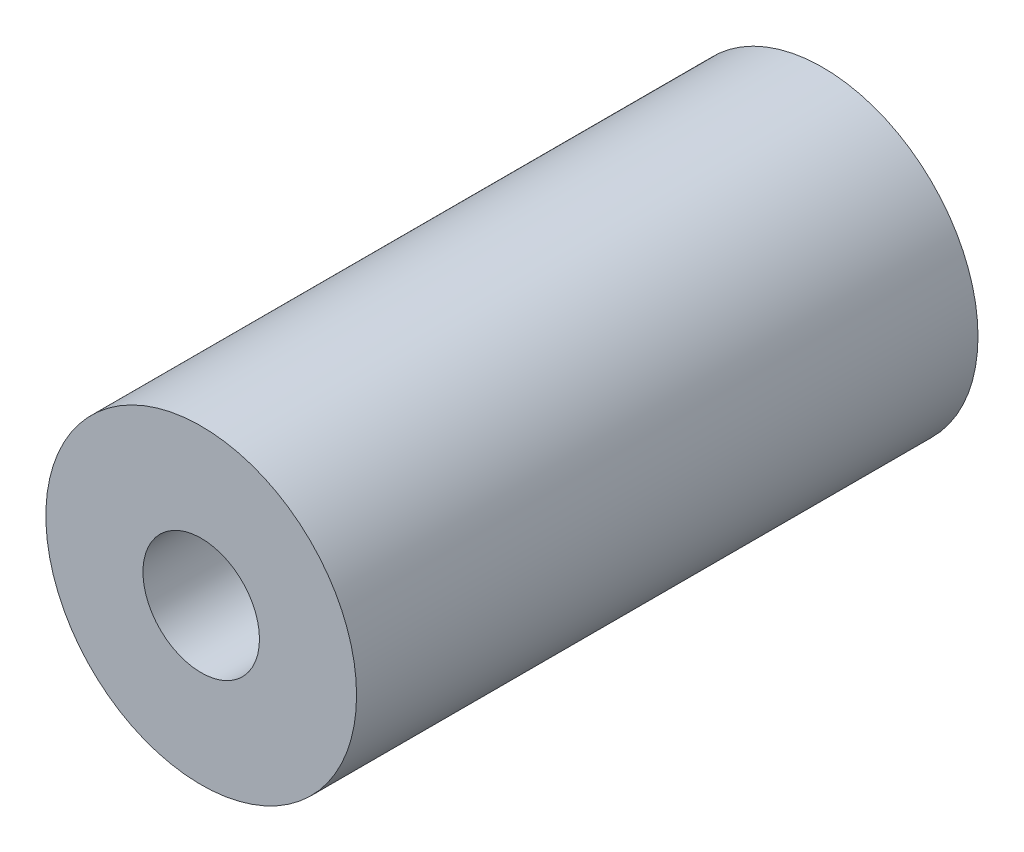
ISO-10303-21;
HEADER;
FILE_DESCRIPTION(('STEP AP214'),'2;1');
FILE_NAME('part.step','',(''),(''),'','','');
FILE_SCHEMA(('AUTOMOTIVE_DESIGN { 1 0 10303 214 1 1 1 1 }'));
ENDSEC;
DATA;
#1=APPLICATION_CONTEXT('core data for automotive mechanical design processes');
#2=APPLICATION_PROTOCOL_DEFINITION('international standard','automotive_design',2000,#1);
#3=PRODUCT_CONTEXT('',#1,'mechanical');
#4=PRODUCT('Part','Part','',(#3));
#5=PRODUCT_RELATED_PRODUCT_CATEGORY('part','',(#4));
#6=PRODUCT_DEFINITION_FORMATION('','',#4);
#7=PRODUCT_DEFINITION_CONTEXT('part definition',#1,'design');
#8=PRODUCT_DEFINITION('design','',#6,#7);
#9=PRODUCT_DEFINITION_SHAPE('','',#8);
#10=(LENGTH_UNIT() NAMED_UNIT(*) SI_UNIT(.MILLI.,.METRE.));
#11=(NAMED_UNIT(*) PLANE_ANGLE_UNIT() SI_UNIT($,.RADIAN.));
#12=(NAMED_UNIT(*) SI_UNIT($,.STERADIAN.) SOLID_ANGLE_UNIT());
#13=UNCERTAINTY_MEASURE_WITH_UNIT(LENGTH_MEASURE(1.E-05),#10,'distance_accuracy_value','');
#14=(GEOMETRIC_REPRESENTATION_CONTEXT(3) GLOBAL_UNCERTAINTY_ASSIGNED_CONTEXT((#13)) GLOBAL_UNIT_ASSIGNED_CONTEXT((#10,
#11,#12)) REPRESENTATION_CONTEXT('',''));
#15=CARTESIAN_POINT('',(0.,0.,0.));
#16=DIRECTION('',(0.,0.,1.));
#17=DIRECTION('',(1.,0.,0.));
#18=AXIS2_PLACEMENT_3D('',#15,#16,#17);
#19=CARTESIAN_POINT('',(0.,0.,16.));
#20=DIRECTION('',(0.,0.,1.));
#21=DIRECTION('',(1.,0.,0.));
#22=AXIS2_PLACEMENT_3D('',#19,#20,#21);
#23=PLANE('',#22);
#24=CARTESIAN_POINT('',(0.,0.,16.));
#25=DIRECTION('',(0.,0.,1.));
#26=DIRECTION('',(1.,0.,0.));
#27=AXIS2_PLACEMENT_3D('',#24,#25,#26);
#28=CIRCLE('',#27,4.);
#29=CARTESIAN_POINT('',(4.,0.,16.));
#30=VERTEX_POINT('',#29);
#31=EDGE_CURVE('E10',#30,#30,#28,.T.);
#32=ORIENTED_EDGE('',*,*,#31,.T.);
#33=EDGE_LOOP('',(#32));
#34=FACE_BOUND('',#33,.T.);
#35=CARTESIAN_POINT('',(0.,0.,16.));
#36=DIRECTION('',(0.,0.,1.));
#37=DIRECTION('',(1.,0.,0.));
#38=AXIS2_PLACEMENT_3D('',#35,#36,#37);
#39=CIRCLE('',#38,1.5);
#40=CARTESIAN_POINT('',(1.5,0.,16.));
#41=VERTEX_POINT('',#40);
#42=EDGE_CURVE('E41',#41,#41,#39,.T.);
#43=ORIENTED_EDGE('',*,*,#42,.F.);
#44=EDGE_LOOP('',(#43));
#45=FACE_BOUND('',#44,.T.);
#46=ADVANCED_FACE('F30',(#34,#45),#23,.T.);
#47=CARTESIAN_POINT('',(0.,0.,0.));
#48=DIRECTION('',(0.,0.,1.));
#49=DIRECTION('',(1.,0.,0.));
#50=AXIS2_PLACEMENT_3D('',#47,#48,#49);
#51=PLANE('',#50);
#52=CARTESIAN_POINT('',(0.,0.,0.));
#53=DIRECTION('',(0.,0.,1.));
#54=DIRECTION('',(1.,0.,0.));
#55=AXIS2_PLACEMENT_3D('',#52,#53,#54);
#56=CIRCLE('',#55,4.);
#57=CARTESIAN_POINT('',(4.,0.,0.));
#58=VERTEX_POINT('',#57);
#59=EDGE_CURVE('E34',#58,#58,#56,.T.);
#60=ORIENTED_EDGE('',*,*,#59,.F.);
#61=EDGE_LOOP('',(#60));
#62=FACE_BOUND('',#61,.T.);
#63=CARTESIAN_POINT('',(0.,0.,0.));
#64=DIRECTION('',(0.,0.,1.));
#65=DIRECTION('',(1.,0.,0.));
#66=AXIS2_PLACEMENT_3D('',#63,#64,#65);
#67=CIRCLE('',#66,1.5);
#68=CARTESIAN_POINT('',(1.5,0.,0.));
#69=VERTEX_POINT('',#68);
#70=EDGE_CURVE('E43',#69,#69,#67,.T.);
#71=ORIENTED_EDGE('',*,*,#70,.T.);
#72=EDGE_LOOP('',(#71));
#73=FACE_BOUND('',#72,.T.);
#74=ADVANCED_FACE('F53',(#62,#73),#51,.F.);
#75=CARTESIAN_POINT('',(0.,0.,16.));
#76=DIRECTION('',(0.,0.,-1.));
#77=DIRECTION('',(-1.,0.,0.));
#78=AXIS2_PLACEMENT_3D('',#75,#76,#77);
#79=CYLINDRICAL_SURFACE('',#78,4.);
#80=ORIENTED_EDGE('',*,*,#31,.F.);
#81=EDGE_LOOP('',(#80));
#82=FACE_BOUND('',#81,.T.);
#83=ORIENTED_EDGE('',*,*,#59,.T.);
#84=EDGE_LOOP('',(#83));
#85=FACE_BOUND('',#84,.T.);
#86=ADVANCED_FACE('F32',(#82,#85),#79,.T.);
#87=CARTESIAN_POINT('',(0.,0.,16.));
#88=DIRECTION('',(0.,0.,-1.));
#89=DIRECTION('',(-1.,0.,0.));
#90=AXIS2_PLACEMENT_3D('',#87,#88,#89);
#91=CYLINDRICAL_SURFACE('',#90,1.5);
#92=ORIENTED_EDGE('',*,*,#42,.T.);
#93=EDGE_LOOP('',(#92));
#94=FACE_BOUND('',#93,.T.);
#95=ORIENTED_EDGE('',*,*,#70,.F.);
#96=EDGE_LOOP('',(#95));
#97=FACE_BOUND('',#96,.T.);
#98=ADVANCED_FACE('F49',(#94,#97),#91,.F.);
#99=CLOSED_SHELL('',(#46,#74,#86,#98));
#100=MANIFOLD_SOLID_BREP('B2',#99);
#101=ADVANCED_BREP_SHAPE_REPRESENTATION('',(#18,#100),#14);
#102=SHAPE_DEFINITION_REPRESENTATION(#9,#101);
ENDSEC;
END-ISO-10303-21;
